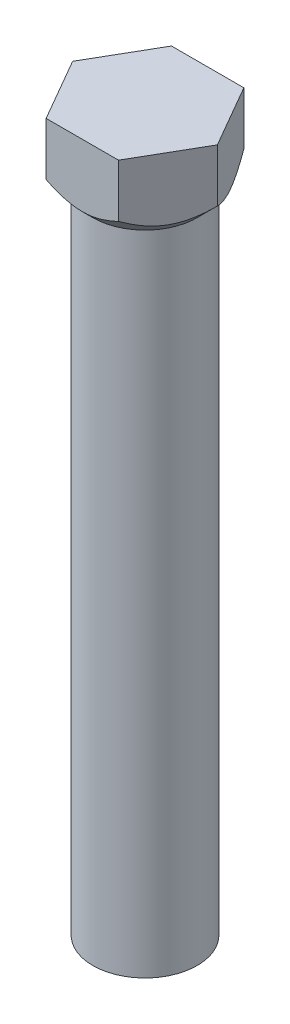
ISO-10303-21;
HEADER;
FILE_DESCRIPTION(('STEP AP214'),'2;1');
FILE_NAME('part.step','',(''),(''),'','','');
FILE_SCHEMA(('AUTOMOTIVE_DESIGN { 1 0 10303 214 1 1 1 1 }'));
ENDSEC;
DATA;
#1=APPLICATION_CONTEXT('core data for automotive mechanical design processes');
#2=APPLICATION_PROTOCOL_DEFINITION('international standard','automotive_design',2000,#1);
#3=PRODUCT_CONTEXT('',#1,'mechanical');
#4=PRODUCT('Part','Part','',(#3));
#5=PRODUCT_RELATED_PRODUCT_CATEGORY('part','',(#4));
#6=PRODUCT_DEFINITION_FORMATION('','',#4);
#7=PRODUCT_DEFINITION_CONTEXT('part definition',#1,'design');
#8=PRODUCT_DEFINITION('design','',#6,#7);
#9=PRODUCT_DEFINITION_SHAPE('','',#8);
#10=(LENGTH_UNIT() NAMED_UNIT(*) SI_UNIT(.MILLI.,.METRE.));
#11=(NAMED_UNIT(*) PLANE_ANGLE_UNIT() SI_UNIT($,.RADIAN.));
#12=(NAMED_UNIT(*) SI_UNIT($,.STERADIAN.) SOLID_ANGLE_UNIT());
#13=UNCERTAINTY_MEASURE_WITH_UNIT(LENGTH_MEASURE(1.E-05),#10,'distance_accuracy_value','');
#14=(GEOMETRIC_REPRESENTATION_CONTEXT(3) GLOBAL_UNCERTAINTY_ASSIGNED_CONTEXT((#13)) GLOBAL_UNIT_ASSIGNED_CONTEXT((#10,
#11,#12)) REPRESENTATION_CONTEXT('',''));
#15=CARTESIAN_POINT('',(0.,0.,0.));
#16=DIRECTION('',(0.,0.,1.));
#17=DIRECTION('',(1.,0.,0.));
#18=AXIS2_PLACEMENT_3D('',#15,#16,#17);
#19=CARTESIAN_POINT('',(0.,32.,0.));
#20=DIRECTION('',(0.,-1.,0.));
#21=DIRECTION('',(0.,0.,-1.));
#22=AXIS2_PLACEMENT_3D('',#19,#20,#21);
#23=CYLINDRICAL_SURFACE('',#22,2.5);
#24=CARTESIAN_POINT('',(0.,31.,0.));
#25=DIRECTION('',(0.,1.,0.));
#26=DIRECTION('',(0.,0.,1.));
#27=AXIS2_PLACEMENT_3D('',#24,#25,#26);
#28=CIRCLE('',#27,2.5);
#29=CARTESIAN_POINT('',(0.,31.,2.5));
#30=VERTEX_POINT('',#29);
#31=EDGE_CURVE('E136',#30,#30,#28,.F.);
#32=ORIENTED_EDGE('',*,*,#31,.T.);
#33=EDGE_LOOP('',(#32));
#34=FACE_BOUND('',#33,.T.);
#35=CARTESIAN_POINT('',(0.,0.,0.));
#36=DIRECTION('',(0.,1.,0.));
#37=DIRECTION('',(0.,0.,1.));
#38=AXIS2_PLACEMENT_3D('',#35,#36,#37);
#39=CIRCLE('',#38,2.5);
#40=CARTESIAN_POINT('',(0.,0.,2.5));
#41=VERTEX_POINT('',#40);
#42=EDGE_CURVE('E131',#41,#41,#39,.T.);
#43=ORIENTED_EDGE('',*,*,#42,.T.);
#44=EDGE_LOOP('',(#43));
#45=FACE_BOUND('',#44,.T.);
#46=ADVANCED_FACE('F41',(#34,#45),#23,.T.);
#47=CARTESIAN_POINT('',(0.,0.,0.));
#48=DIRECTION('',(0.,1.,0.));
#49=DIRECTION('',(0.,0.,1.));
#50=AXIS2_PLACEMENT_3D('',#47,#48,#49);
#51=PLANE('',#50);
#52=ORIENTED_EDGE('',*,*,#42,.F.);
#53=EDGE_LOOP('',(#52));
#54=FACE_BOUND('',#53,.T.);
#55=ADVANCED_FACE('F207',(#54),#51,.F.);
#56=CARTESIAN_POINT('',(1.73205080756888,34.5,3.));
#57=DIRECTION('',(-0.866025403784439,0.,-0.5));
#58=DIRECTION('',(-0.5,0.,0.866025403784439));
#59=AXIS2_PLACEMENT_3D('',#56,#57,#58);
#60=PLANE('',#59);
#61=DIRECTION('',(0.,-1.,0.));
#62=VECTOR('',#61,1.);
#63=CARTESIAN_POINT('',(1.73205080756888,34.5,3.));
#64=LINE('',#63,#62);
#65=CARTESIAN_POINT('',(1.73205080756888,34.5,3.));
#66=VERTEX_POINT('',#65);
#67=CARTESIAN_POINT('',(1.73205080756888,31.9641016151377,3.));
#68=VERTEX_POINT('',#67);
#69=EDGE_CURVE('E224',#66,#68,#64,.T.);
#70=ORIENTED_EDGE('',*,*,#69,.T.);
#71=CARTESIAN_POINT('',(1.73205080756888,31.9641016151377,3.));
#72=CARTESIAN_POINT('',(1.79158223583307,31.9046273115043,2.89688854159927));
#73=CARTESIAN_POINT('',(1.85210903668866,31.8486466143714,2.7920530472978));
#74=CARTESIAN_POINT('',(1.97552939498814,31.7461483479953,2.57828271603473));
#75=CARTESIAN_POINT('',(2.03843468330082,31.6996877901198,2.4693275606124));
#76=CARTESIAN_POINT('',(2.1652800998431,31.6201005343435,2.24962485445395));
#77=CARTESIAN_POINT('',(2.22918794196515,31.586773851006,2.13893322489645));
#78=CARTESIAN_POINT('',(2.35841021276463,31.5354277758299,1.91511368640234));
#79=CARTESIAN_POINT('',(2.42372069661043,31.517370070364,1.8019926101145));
#80=CARTESIAN_POINT('',(2.53628617623579,31.5010768517386,1.60702348022503));
#81=CARTESIAN_POINT('',(2.58339589155694,31.4986656112775,1.52542705975868));
#82=CARTESIAN_POINT('',(2.67753863320617,31.502733133148,1.36236704805839));
#83=CARTESIAN_POINT('',(2.72457162686998,31.5092150115048,1.2809035134006));
#84=CARTESIAN_POINT('',(2.81819196299703,31.5306986609621,1.11874833460687));
#85=CARTESIAN_POINT('',(2.86477874788302,31.5457099577167,1.03805765622306));
#86=CARTESIAN_POINT('',(2.95715218442952,31.5834331286294,0.87806217085478));
#87=CARTESIAN_POINT('',(3.00293889717068,31.6061444122156,0.798757258075532));
#88=CARTESIAN_POINT('',(3.08421278897891,31.6528653293044,0.65798674813481));
#89=CARTESIAN_POINT('',(3.1198800745028,31.675645478675,0.596209197439379));
#90=CARTESIAN_POINT('',(3.19057450439273,31.7248761548282,0.473762853057907));
#91=CARTESIAN_POINT('',(3.22560162942291,31.7513267922701,0.413094092862562));
#92=CARTESIAN_POINT('',(3.29490536774248,31.8073056985693,0.293056496938608));
#93=CARTESIAN_POINT('',(3.32918395197357,31.8368242879627,0.233684247438823));
#94=CARTESIAN_POINT('',(3.39710647983643,31.898551669424,0.116038978201852));
#95=CARTESIAN_POINT('',(3.43075079712837,31.9307588127747,0.0577653112662344));
#96=CARTESIAN_POINT('',(3.46410161513775,31.9641016151377,0.));
#97=B_SPLINE_CURVE_WITH_KNOTS('',3,(#71,#72,#73,#74,#75,#76,#77,#78,#79,#80,#81,#82,#83,#84,#85,
#86,#87,#88,#89,#90,#91,#92,#93,#94,#95,#96),.UNSPECIFIED.,.F.,.F.,(4,2,2,2,2,2,2,2,2,2,2,2,4),
(0.,0.399548839742047,0.801424624398827,1.19691998044429,1.59141997110856,1.87377108834638,
2.15622116276,2.43898729915556,2.72173175291771,2.94627735489484,3.17082972803501,
3.39469398397017,3.61842195288713),.UNSPECIFIED.);
#98=CARTESIAN_POINT('',(3.46410161513775,31.9641016151377,0.));
#99=VERTEX_POINT('',#98);
#100=EDGE_CURVE('E128',#68,#99,#97,.T.);
#101=ORIENTED_EDGE('',*,*,#100,.T.);
#102=DIRECTION('',(0.,-1.,0.));
#103=VECTOR('',#102,1.);
#104=CARTESIAN_POINT('',(3.46410161513775,34.5,0.));
#105=LINE('',#104,#103);
#106=CARTESIAN_POINT('',(3.46410161513775,34.5,0.));
#107=VERTEX_POINT('',#106);
#108=EDGE_CURVE('E110',#107,#99,#105,.T.);
#109=ORIENTED_EDGE('',*,*,#108,.F.);
#110=DIRECTION('',(0.5,0.,-0.866025403784439));
#111=VECTOR('',#110,1.);
#112=CARTESIAN_POINT('',(1.73205080756888,34.5,3.));
#113=LINE('',#112,#111);
#114=EDGE_CURVE('E117',#66,#107,#113,.T.);
#115=ORIENTED_EDGE('',*,*,#114,.F.);
#116=EDGE_LOOP('',(#70,#101,#109,#115));
#117=FACE_BOUND('',#116,.T.);
#118=ADVANCED_FACE('F126',(#117),#60,.F.);
#119=CARTESIAN_POINT('',(3.46410161513775,34.5,0.));
#120=DIRECTION('',(-0.866025403784439,0.,0.5));
#121=DIRECTION('',(0.5,0.,0.866025403784439));
#122=AXIS2_PLACEMENT_3D('',#119,#120,#121);
#123=PLANE('',#122);
#124=ORIENTED_EDGE('',*,*,#108,.T.);
#125=CARTESIAN_POINT('',(3.46410161513775,31.9641016151377,0.));
#126=CARTESIAN_POINT('',(3.40457018687356,31.9046273115043,-0.103111458400732));
#127=CARTESIAN_POINT('',(3.34404338601798,31.8486466143714,-0.207946952702201));
#128=CARTESIAN_POINT('',(3.22062302771849,31.7461483479953,-0.421717283965269));
#129=CARTESIAN_POINT('',(3.15771773940581,31.6996877901198,-0.530672439387603));
#130=CARTESIAN_POINT('',(3.03087232286354,31.6201005343435,-0.750375145546052));
#131=CARTESIAN_POINT('',(2.96696448074148,31.586773851006,-0.861066775103547));
#132=CARTESIAN_POINT('',(2.837742209942,31.5354277758299,-1.08488631359766));
#133=CARTESIAN_POINT('',(2.7724317260962,31.517370070364,-1.1980073898855));
#134=CARTESIAN_POINT('',(2.65986624647085,31.5010768517386,-1.39297651977497));
#135=CARTESIAN_POINT('',(2.61275653114969,31.4986656112775,-1.47457294024132));
#136=CARTESIAN_POINT('',(2.51861378950047,31.502733133148,-1.63763295194161));
#137=CARTESIAN_POINT('',(2.47158079583665,31.5092150115048,-1.7190964865994));
#138=CARTESIAN_POINT('',(2.3779604597096,31.5306986609621,-1.88125166539313));
#139=CARTESIAN_POINT('',(2.33137367482361,31.5457099577167,-1.96194234377694));
#140=CARTESIAN_POINT('',(2.23900023827711,31.5834331286294,-2.12193782914522));
#141=CARTESIAN_POINT('',(2.19321352553595,31.6061444122156,-2.20124274192447));
#142=CARTESIAN_POINT('',(2.11193963372772,31.6528653293044,-2.34201325186519));
#143=CARTESIAN_POINT('',(2.07627234820383,31.675645478675,-2.40379080256062));
#144=CARTESIAN_POINT('',(2.0055779183139,31.7248761548282,-2.52623714694209));
#145=CARTESIAN_POINT('',(1.97055079328372,31.7513267922701,-2.58690590713744));
#146=CARTESIAN_POINT('',(1.90124705496415,31.8073056985693,-2.70694350306139));
#147=CARTESIAN_POINT('',(1.86696847073306,31.8368242879627,-2.76631575256118));
#148=CARTESIAN_POINT('',(1.79904594287021,31.898551669424,-2.88396102179815));
#149=CARTESIAN_POINT('',(1.76540162557826,31.9307588127747,-2.94223468873376));
#150=CARTESIAN_POINT('',(1.73205080756888,31.9641016151377,-3.));
#151=B_SPLINE_CURVE_WITH_KNOTS('',3,(#125,#126,#127,#128,#129,#130,#131,#132,#133,#134,#135,
#136,#137,#138,#139,#140,#141,#142,#143,#144,#145,#146,#147,#148,#149,#150),.UNSPECIFIED.,.F.,
.F.,(4,2,2,2,2,2,2,2,2,2,2,2,4),(0.,0.399548839742046,0.801424624398827,1.19691998044429,
1.59141997110856,1.87377108834638,2.15622116276,2.43898729915556,2.72173175291771,
2.94627735489484,3.17082972803501,3.39469398397017,3.61842195288713),.UNSPECIFIED.);
#152=CARTESIAN_POINT('',(1.73205080756888,31.9641016151377,-3.));
#153=VERTEX_POINT('',#152);
#154=EDGE_CURVE('E192',#99,#153,#151,.T.);
#155=ORIENTED_EDGE('',*,*,#154,.T.);
#156=DIRECTION('',(0.,-1.,0.));
#157=VECTOR('',#156,1.);
#158=CARTESIAN_POINT('',(1.73205080756888,34.5,-3.));
#159=LINE('',#158,#157);
#160=CARTESIAN_POINT('',(1.73205080756888,34.5,-3.));
#161=VERTEX_POINT('',#160);
#162=EDGE_CURVE('E112',#161,#153,#159,.T.);
#163=ORIENTED_EDGE('',*,*,#162,.F.);
#164=DIRECTION('',(-0.5,0.,-0.866025403784438));
#165=VECTOR('',#164,1.);
#166=CARTESIAN_POINT('',(3.46410161513775,34.5,0.));
#167=LINE('',#166,#165);
#168=EDGE_CURVE('E105',#107,#161,#167,.T.);
#169=ORIENTED_EDGE('',*,*,#168,.F.);
#170=EDGE_LOOP('',(#124,#155,#163,#169));
#171=FACE_BOUND('',#170,.T.);
#172=ADVANCED_FACE('F107',(#171),#123,.F.);
#173=CARTESIAN_POINT('',(1.73205080756888,34.5,-3.));
#174=DIRECTION('',(0.,0.,1.));
#175=DIRECTION('',(1.,0.,0.));
#176=AXIS2_PLACEMENT_3D('',#173,#174,#175);
#177=PLANE('',#176);
#178=ORIENTED_EDGE('',*,*,#162,.T.);
#179=CARTESIAN_POINT('',(1.73205080756888,31.9641016151377,-3.));
#180=CARTESIAN_POINT('',(1.61298795104048,31.9046273115043,-3.));
#181=CARTESIAN_POINT('',(1.49193434932932,31.8486466143714,-3.));
#182=CARTESIAN_POINT('',(1.24509363273035,31.7461483479953,-3.));
#183=CARTESIAN_POINT('',(1.11928305610498,31.6996877901198,-3.));
#184=CARTESIAN_POINT('',(0.865592223020442,31.6201005343435,-3.));
#185=CARTESIAN_POINT('',(0.737776538776327,31.586773851006,-3.));
#186=CARTESIAN_POINT('',(0.479331997177374,31.5354277758299,-3.));
#187=CARTESIAN_POINT('',(0.348711029485772,31.517370070364,-3.));
#188=CARTESIAN_POINT('',(0.123580070235061,31.5010768517386,-3.));
#189=CARTESIAN_POINT('',(0.0293606395927468,31.4986656112775,-3.));
#190=CARTESIAN_POINT('',(-0.1589248437057,31.502733133148,-3.));
#191=CARTESIAN_POINT('',(-0.252990831033323,31.5092150115048,-3.));
#192=CARTESIAN_POINT('',(-0.440231503287431,31.5306986609621,-3.));
#193=CARTESIAN_POINT('',(-0.533405073059408,31.5457099577167,-3.));
#194=CARTESIAN_POINT('',(-0.718151946152407,31.5834331286294,-3.));
#195=CARTESIAN_POINT('',(-0.809725371634725,31.6061444122156,-3.));
#196=CARTESIAN_POINT('',(-0.972273155251198,31.6528653293044,-3.));
#197=CARTESIAN_POINT('',(-1.04360772629896,31.675645478675,-3.));
#198=CARTESIAN_POINT('',(-1.18499658607882,31.7248761548282,-3.));
#199=CARTESIAN_POINT('',(-1.25505083613919,31.7513267922701,-3.));
#200=CARTESIAN_POINT('',(-1.39365831277833,31.8073056985693,-3.));
#201=CARTESIAN_POINT('',(-1.46221548124052,31.8368242879627,-3.));
#202=CARTESIAN_POINT('',(-1.59806053696622,31.898551669424,-3.));
#203=CARTESIAN_POINT('',(-1.66534917155011,31.9307588127747,-3.));
#204=CARTESIAN_POINT('',(-1.73205080756888,31.9641016151377,-3.));
#205=B_SPLINE_CURVE_WITH_KNOTS('',3,(#179,#180,#181,#182,#183,#184,#185,#186,#187,#188,#189,
#190,#191,#192,#193,#194,#195,#196,#197,#198,#199,#200,#201,#202,#203,#204),.UNSPECIFIED.,.F.,
.F.,(4,2,2,2,2,2,2,2,2,2,2,2,4),(0.,0.399548839742046,0.801424624398827,1.19691998044429,
1.59141997110856,1.87377108834638,2.15622116276,2.43898729915556,2.72173175291771,
2.94627735489484,3.17082972803501,3.39469398397017,3.61842195288713),.UNSPECIFIED.);
#206=CARTESIAN_POINT('',(-1.73205080756888,31.9641016151377,-3.));
#207=VERTEX_POINT('',#206);
#208=EDGE_CURVE('E185',#153,#207,#205,.T.);
#209=ORIENTED_EDGE('',*,*,#208,.T.);
#210=DIRECTION('',(0.,-1.,0.));
#211=VECTOR('',#210,1.);
#212=CARTESIAN_POINT('',(-1.73205080756888,34.5,-3.));
#213=LINE('',#212,#211);
#214=CARTESIAN_POINT('',(-1.73205080756888,34.5,-3.));
#215=VERTEX_POINT('',#214);
#216=EDGE_CURVE('E138',#215,#207,#213,.T.);
#217=ORIENTED_EDGE('',*,*,#216,.F.);
#218=DIRECTION('',(-1.,0.,0.));
#219=VECTOR('',#218,1.);
#220=CARTESIAN_POINT('',(1.73205080756888,34.5,-3.));
#221=LINE('',#220,#219);
#222=EDGE_CURVE('E116',#161,#215,#221,.T.);
#223=ORIENTED_EDGE('',*,*,#222,.F.);
#224=EDGE_LOOP('',(#178,#209,#217,#223));
#225=FACE_BOUND('',#224,.T.);
#226=ADVANCED_FACE('F198',(#225),#177,.F.);
#227=CARTESIAN_POINT('',(-1.73205080756888,34.5,-3.));
#228=DIRECTION('',(0.866025403784439,0.,0.5));
#229=DIRECTION('',(0.5,0.,-0.866025403784439));
#230=AXIS2_PLACEMENT_3D('',#227,#228,#229);
#231=PLANE('',#230);
#232=ORIENTED_EDGE('',*,*,#216,.T.);
#233=CARTESIAN_POINT('',(-1.73205080756888,31.9641016151377,-3.));
#234=CARTESIAN_POINT('',(-1.79158223583307,31.9046273115043,-2.89688854159927));
#235=CARTESIAN_POINT('',(-1.85210903668866,31.8486466143714,-2.7920530472978));
#236=CARTESIAN_POINT('',(-1.97552939498814,31.7461483479953,-2.57828271603473));
#237=CARTESIAN_POINT('',(-2.03843468330082,31.6996877901198,-2.4693275606124));
#238=CARTESIAN_POINT('',(-2.1652800998431,31.6201005343435,-2.24962485445395));
#239=CARTESIAN_POINT('',(-2.22918794196515,31.586773851006,-2.13893322489645));
#240=CARTESIAN_POINT('',(-2.35841021276463,31.5354277758299,-1.91511368640234));
#241=CARTESIAN_POINT('',(-2.42372069661043,31.517370070364,-1.8019926101145));
#242=CARTESIAN_POINT('',(-2.53628617623579,31.5010768517386,-1.60702348022503));
#243=CARTESIAN_POINT('',(-2.58339589155694,31.4986656112775,-1.52542705975868));
#244=CARTESIAN_POINT('',(-2.67753863320617,31.502733133148,-1.36236704805839));
#245=CARTESIAN_POINT('',(-2.72457162686998,31.5092150115048,-1.28090351340061));
#246=CARTESIAN_POINT('',(-2.81819196299703,31.5306986609621,-1.11874833460687));
#247=CARTESIAN_POINT('',(-2.86477874788302,31.5457099577167,-1.03805765622306));
#248=CARTESIAN_POINT('',(-2.95715218442952,31.5834331286294,-0.878062170854781));
#249=CARTESIAN_POINT('',(-3.00293889717068,31.6061444122156,-0.798757258075532));
#250=CARTESIAN_POINT('',(-3.08421278897891,31.6528653293044,-0.657986748134813));
#251=CARTESIAN_POINT('',(-3.1198800745028,31.675645478675,-0.596209197439383));
#252=CARTESIAN_POINT('',(-3.19057450439272,31.7248761548282,-0.473762853057912));
#253=CARTESIAN_POINT('',(-3.22560162942291,31.7513267922701,-0.413094092862566));
#254=CARTESIAN_POINT('',(-3.29490536774248,31.8073056985693,-0.29305649693861));
#255=CARTESIAN_POINT('',(-3.32918395197357,31.8368242879627,-0.233684247438824));
#256=CARTESIAN_POINT('',(-3.39710647983643,31.898551669424,-0.116038978201853));
#257=CARTESIAN_POINT('',(-3.43075079712837,31.9307588127747,-0.0577653112662356));
#258=CARTESIAN_POINT('',(-3.46410161513775,31.9641016151377,0.));
#259=B_SPLINE_CURVE_WITH_KNOTS('',3,(#233,#234,#235,#236,#237,#238,#239,#240,#241,#242,#243,
#244,#245,#246,#247,#248,#249,#250,#251,#252,#253,#254,#255,#256,#257,#258),.UNSPECIFIED.,.F.,
.F.,(4,2,2,2,2,2,2,2,2,2,2,2,4),(0.,0.399548839742047,0.801424624398827,1.19691998044429,
1.59141997110856,1.87377108834638,2.15622116276,2.43898729915556,2.72173175291771,
2.94627735489484,3.17082972803501,3.39469398397017,3.61842195288713),.UNSPECIFIED.);
#260=CARTESIAN_POINT('',(-3.46410161513775,31.9641016151377,0.));
#261=VERTEX_POINT('',#260);
#262=EDGE_CURVE('E178',#207,#261,#259,.T.);
#263=ORIENTED_EDGE('',*,*,#262,.T.);
#264=DIRECTION('',(0.,-1.,0.));
#265=VECTOR('',#264,1.);
#266=CARTESIAN_POINT('',(-3.46410161513775,34.5,0.));
#267=LINE('',#266,#265);
#268=CARTESIAN_POINT('',(-3.46410161513775,34.5,0.));
#269=VERTEX_POINT('',#268);
#270=EDGE_CURVE('E70',#269,#261,#267,.T.);
#271=ORIENTED_EDGE('',*,*,#270,.F.);
#272=DIRECTION('',(-0.5,0.,0.866025403784439));
#273=VECTOR('',#272,1.);
#274=CARTESIAN_POINT('',(-1.73205080756888,34.5,-3.));
#275=LINE('',#274,#273);
#276=EDGE_CURVE('E235',#215,#269,#275,.T.);
#277=ORIENTED_EDGE('',*,*,#276,.F.);
#278=EDGE_LOOP('',(#232,#263,#271,#277));
#279=FACE_BOUND('',#278,.T.);
#280=ADVANCED_FACE('F169',(#279),#231,.F.);
#281=CARTESIAN_POINT('',(-3.46410161513775,34.5,0.));
#282=DIRECTION('',(0.866025403784439,0.,-0.5));
#283=DIRECTION('',(-0.5,0.,-0.866025403784439));
#284=AXIS2_PLACEMENT_3D('',#281,#282,#283);
#285=PLANE('',#284);
#286=ORIENTED_EDGE('',*,*,#270,.T.);
#287=CARTESIAN_POINT('',(-3.46410161513775,31.9641016151377,0.));
#288=CARTESIAN_POINT('',(-3.40457018687356,31.9046273115043,0.10311145840073));
#289=CARTESIAN_POINT('',(-3.34404338601798,31.8486466143714,0.207946952702199));
#290=CARTESIAN_POINT('',(-3.22062302771849,31.7461483479953,0.421717283965268));
#291=CARTESIAN_POINT('',(-3.15771773940581,31.6996877901198,0.530672439387603));
#292=CARTESIAN_POINT('',(-3.03087232286354,31.6201005343435,0.750375145546054));
#293=CARTESIAN_POINT('',(-2.96696448074148,31.586773851006,0.861066775103549));
#294=CARTESIAN_POINT('',(-2.837742209942,31.5354277758299,1.08488631359767));
#295=CARTESIAN_POINT('',(-2.7724317260962,31.517370070364,1.1980073898855));
#296=CARTESIAN_POINT('',(-2.65986624647085,31.5010768517386,1.39297651977497));
#297=CARTESIAN_POINT('',(-2.61275653114969,31.4986656112775,1.47457294024132));
#298=CARTESIAN_POINT('',(-2.51861378950047,31.502733133148,1.63763295194161));
#299=CARTESIAN_POINT('',(-2.47158079583665,31.5092150115048,1.71909648659939));
#300=CARTESIAN_POINT('',(-2.3779604597096,31.5306986609621,1.88125166539313));
#301=CARTESIAN_POINT('',(-2.33137367482361,31.5457099577167,1.96194234377694));
#302=CARTESIAN_POINT('',(-2.23900023827711,31.5834331286294,2.12193782914522));
#303=CARTESIAN_POINT('',(-2.19321352553595,31.6061444122156,2.20124274192447));
#304=CARTESIAN_POINT('',(-2.11193963372772,31.6528653293044,2.34201325186519));
#305=CARTESIAN_POINT('',(-2.07627234820383,31.675645478675,2.40379080256062));
#306=CARTESIAN_POINT('',(-2.00557791831391,31.7248761548282,2.52623714694209));
#307=CARTESIAN_POINT('',(-1.97055079328372,31.7513267922701,2.58690590713744));
#308=CARTESIAN_POINT('',(-1.90124705496415,31.8073056985693,2.70694350306139));
#309=CARTESIAN_POINT('',(-1.86696847073306,31.8368242879627,2.76631575256118));
#310=CARTESIAN_POINT('',(-1.79904594287021,31.898551669424,2.88396102179815));
#311=CARTESIAN_POINT('',(-1.76540162557826,31.9307588127747,2.94223468873377));
#312=CARTESIAN_POINT('',(-1.73205080756888,31.9641016151377,3.));
#313=B_SPLINE_CURVE_WITH_KNOTS('',3,(#287,#288,#289,#290,#291,#292,#293,#294,#295,#296,#297,
#298,#299,#300,#301,#302,#303,#304,#305,#306,#307,#308,#309,#310,#311,#312),.UNSPECIFIED.,.F.,
.F.,(4,2,2,2,2,2,2,2,2,2,2,2,4),(0.,0.399548839742045,0.801424624398828,1.19691998044429,
1.59141997110856,1.87377108834638,2.15622116276,2.43898729915556,2.72173175291771,
2.94627735489484,3.17082972803502,3.39469398397018,3.61842195288713),.UNSPECIFIED.);
#314=CARTESIAN_POINT('',(-1.73205080756888,31.9641016151377,3.));
#315=VERTEX_POINT('',#314);
#316=EDGE_CURVE('E57',#261,#315,#313,.T.);
#317=ORIENTED_EDGE('',*,*,#316,.T.);
#318=DIRECTION('',(0.,-1.,0.));
#319=VECTOR('',#318,1.);
#320=CARTESIAN_POINT('',(-1.73205080756888,34.5,3.));
#321=LINE('',#320,#319);
#322=CARTESIAN_POINT('',(-1.73205080756888,34.5,3.));
#323=VERTEX_POINT('',#322);
#324=EDGE_CURVE('E63',#323,#315,#321,.T.);
#325=ORIENTED_EDGE('',*,*,#324,.F.);
#326=DIRECTION('',(0.5,0.,0.866025403784439));
#327=VECTOR('',#326,1.);
#328=CARTESIAN_POINT('',(-3.46410161513775,34.5,0.));
#329=LINE('',#328,#327);
#330=EDGE_CURVE('E227',#269,#323,#329,.T.);
#331=ORIENTED_EDGE('',*,*,#330,.F.);
#332=EDGE_LOOP('',(#286,#317,#325,#331));
#333=FACE_BOUND('',#332,.T.);
#334=ADVANCED_FACE('F164',(#333),#285,.F.);
#335=CARTESIAN_POINT('',(-1.73205080756888,34.5,3.));
#336=DIRECTION('',(0.,0.,-1.));
#337=DIRECTION('',(-1.,0.,0.));
#338=AXIS2_PLACEMENT_3D('',#335,#336,#337);
#339=PLANE('',#338);
#340=ORIENTED_EDGE('',*,*,#324,.T.);
#341=CARTESIAN_POINT('',(-1.73205080756888,31.9641016151377,3.));
#342=CARTESIAN_POINT('',(-1.61158130056292,31.9039270925754,3.));
#343=CARTESIAN_POINT('',(-1.48906899529189,31.8473238007792,3.));
#344=CARTESIAN_POINT('',(-1.23916863086448,31.7438277500843,3.));
#345=CARTESIAN_POINT('',(-1.11175533962696,31.6969964814408,3.));
#346=CARTESIAN_POINT('',(-0.857829050890819,31.618004248701,3.));
#347=CARTESIAN_POINT('',(-0.731477750138242,31.5853387229255,3.));
#348=CARTESIAN_POINT('',(-0.476120226431711,31.5349792871902,3.));
#349=CARTESIAN_POINT('',(-0.347122572275608,31.5172430787005,3.));
#350=CARTESIAN_POINT('',(-0.0971017275580624,31.4991717306575,3.));
#351=CARTESIAN_POINT('',(0.0238348104058056,31.4976868489676,3.));
#352=CARTESIAN_POINT('',(0.205761135643639,31.506418158193,3.));
#353=CARTESIAN_POINT('',(0.26705544321029,31.5112516610013,3.));
#354=CARTESIAN_POINT('',(0.389231505897684,31.5245343328425,3.));
#355=CARTESIAN_POINT('',(0.450113392915465,31.5329822845235,3.));
#356=CARTESIAN_POINT('',(0.510710246237187,31.5431603565392,3.));
#357=B_SPLINE_CURVE_WITH_KNOTS('',3,(#341,#342,#343,#344,#345,#346,#347,#348,#349,#350,#351,
#352,#353,#354,#355,#356),.UNSPECIFIED.,.F.,.F.,(4,2,2,2,2,2,2,4),(0.,0.404279209292088,
0.811030343718727,1.20178323416188,1.59142526037705,1.95330647249638,2.13766516624025,
2.32196181651449),.UNSPECIFIED.);
#358=CARTESIAN_POINT('',(0.510710246237188,31.5431603565392,3.));
#359=VERTEX_POINT('',#358);
#360=EDGE_CURVE('E11',#315,#359,#357,.T.);
#361=ORIENTED_EDGE('',*,*,#360,.T.);
#362=CARTESIAN_POINT('',(0.510710246237188,31.5431603565392,3.));
#363=CARTESIAN_POINT('',(0.617724154161645,31.5610800623189,3.));
#364=CARTESIAN_POINT('',(0.723691842061695,31.584391257025,3.));
#365=CARTESIAN_POINT('',(0.932631546532361,31.6400288887305,3.));
#366=CARTESIAN_POINT('',(1.03561683354726,31.672305037876,3.));
#367=CARTESIAN_POINT('',(1.23875062574216,31.7442943295452,3.));
#368=CARTESIAN_POINT('',(1.33890239045604,31.783998490478,3.));
#369=CARTESIAN_POINT('',(1.53714990215712,31.8696980234631,3.));
#370=CARTESIAN_POINT('',(1.63523122849002,31.9157269497922,3.));
#371=CARTESIAN_POINT('',(1.73205080756888,31.9641016151377,3.));
#372=B_SPLINE_CURVE_WITH_KNOTS('',3,(#362,#363,#364,#365,#366,#367,#368,#369,#370,#371),
.UNSPECIFIED.,.F.,.F.,(4,2,2,2,4),(0.,0.325172061041543,0.648555715810884,0.97155084881294,
1.29633093444722),.UNSPECIFIED.);
#373=EDGE_CURVE('E145',#359,#68,#372,.T.);
#374=ORIENTED_EDGE('',*,*,#373,.T.);
#375=ORIENTED_EDGE('',*,*,#69,.F.);
#376=DIRECTION('',(1.,0.,0.));
#377=VECTOR('',#376,1.);
#378=CARTESIAN_POINT('',(-1.73205080756888,34.5,3.));
#379=LINE('',#378,#377);
#380=EDGE_CURVE('E121',#323,#66,#379,.T.);
#381=ORIENTED_EDGE('',*,*,#380,.F.);
#382=EDGE_LOOP('',(#340,#361,#374,#375,#381));
#383=FACE_BOUND('',#382,.T.);
#384=ADVANCED_FACE('F159',(#383),#339,.F.);
#385=CARTESIAN_POINT('',(0.,34.5,0.));
#386=DIRECTION('',(0.,1.,0.));
#387=DIRECTION('',(0.,0.,1.));
#388=AXIS2_PLACEMENT_3D('',#385,#386,#387);
#389=PLANE('',#388);
#390=ORIENTED_EDGE('',*,*,#114,.T.);
#391=ORIENTED_EDGE('',*,*,#168,.T.);
#392=ORIENTED_EDGE('',*,*,#222,.T.);
#393=ORIENTED_EDGE('',*,*,#276,.T.);
#394=ORIENTED_EDGE('',*,*,#330,.T.);
#395=ORIENTED_EDGE('',*,*,#380,.T.);
#396=EDGE_LOOP('',(#390,#391,#392,#393,#394,#395));
#397=FACE_BOUND('',#396,.T.);
#398=ADVANCED_FACE('F120',(#397),#389,.T.);
#399=CARTESIAN_POINT('',(0.,32.,0.));
#400=DIRECTION('',(0.,1.,0.));
#401=DIRECTION('',(0.,0.,1.));
#402=AXIS2_PLACEMENT_3D('',#399,#400,#401);
#403=CONICAL_SURFACE('',#402,3.50000000000002,0.785398163397453);
#404=ORIENTED_EDGE('',*,*,#31,.F.);
#405=EDGE_LOOP('',(#404));
#406=FACE_BOUND('',#405,.T.);
#407=ORIENTED_EDGE('',*,*,#100,.F.);
#408=ORIENTED_EDGE('',*,*,#373,.F.);
#409=ORIENTED_EDGE('',*,*,#360,.F.);
#410=ORIENTED_EDGE('',*,*,#316,.F.);
#411=ORIENTED_EDGE('',*,*,#262,.F.);
#412=ORIENTED_EDGE('',*,*,#208,.F.);
#413=ORIENTED_EDGE('',*,*,#154,.F.);
#414=EDGE_LOOP('',(#407,#408,#409,#410,#411,#412,#413));
#415=FACE_BOUND('',#414,.T.);
#416=ADVANCED_FACE('F44',(#406,#415),#403,.T.);
#417=CLOSED_SHELL('',(#46,#55,#118,#172,#226,#280,#334,#384,#398,#416));
#418=MANIFOLD_SOLID_BREP('B2',#417);
#419=ADVANCED_BREP_SHAPE_REPRESENTATION('',(#18,#418),#14);
#420=SHAPE_DEFINITION_REPRESENTATION(#9,#419);
ENDSEC;
END-ISO-10303-21;
